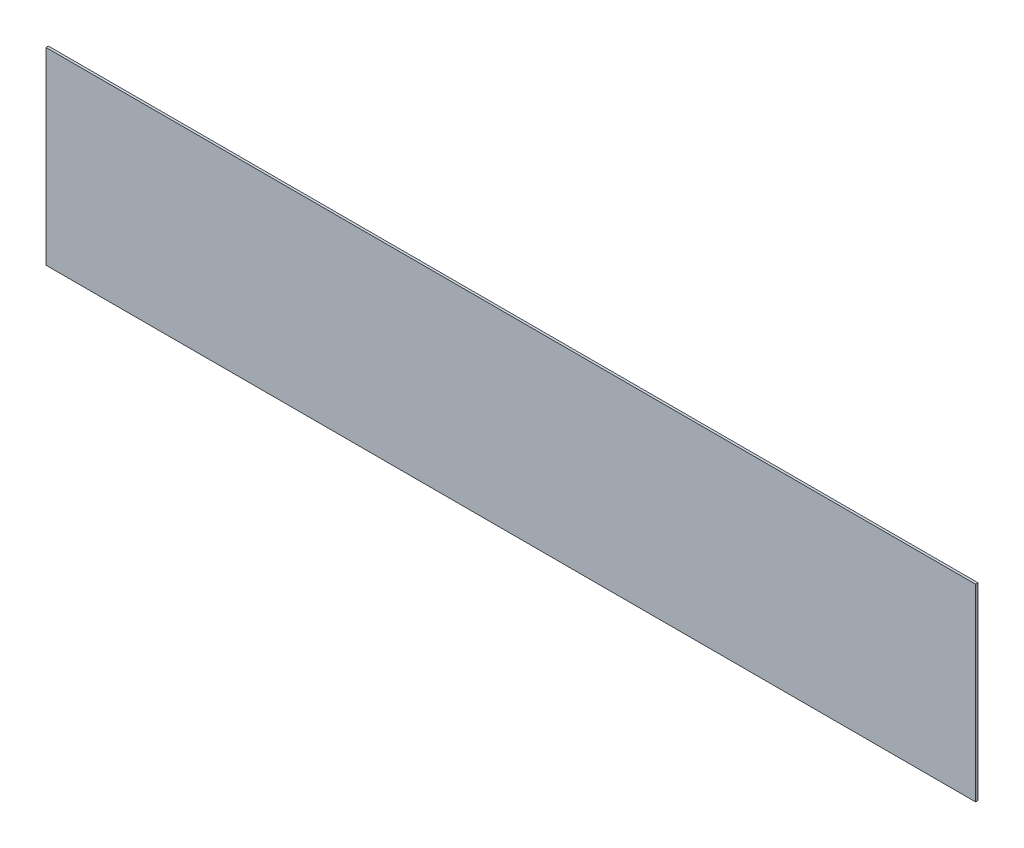
ISO-10303-21;
HEADER;
FILE_DESCRIPTION(('STEP AP214'),'2;1');
FILE_NAME('part.step','',(''),(''),'','','');
FILE_SCHEMA(('AUTOMOTIVE_DESIGN { 1 0 10303 214 1 1 1 1 }'));
ENDSEC;
DATA;
#1=APPLICATION_CONTEXT('core data for automotive mechanical design processes');
#2=APPLICATION_PROTOCOL_DEFINITION('international standard','automotive_design',2000,#1);
#3=PRODUCT_CONTEXT('',#1,'mechanical');
#4=PRODUCT('Part','Part','',(#3));
#5=PRODUCT_RELATED_PRODUCT_CATEGORY('part','',(#4));
#6=PRODUCT_DEFINITION_FORMATION('','',#4);
#7=PRODUCT_DEFINITION_CONTEXT('part definition',#1,'design');
#8=PRODUCT_DEFINITION('design','',#6,#7);
#9=PRODUCT_DEFINITION_SHAPE('','',#8);
#10=(LENGTH_UNIT() NAMED_UNIT(*) SI_UNIT(.MILLI.,.METRE.));
#11=(NAMED_UNIT(*) PLANE_ANGLE_UNIT() SI_UNIT($,.RADIAN.));
#12=(NAMED_UNIT(*) SI_UNIT($,.STERADIAN.) SOLID_ANGLE_UNIT());
#13=UNCERTAINTY_MEASURE_WITH_UNIT(LENGTH_MEASURE(1.E-05),#10,'distance_accuracy_value','');
#14=(GEOMETRIC_REPRESENTATION_CONTEXT(3) GLOBAL_UNCERTAINTY_ASSIGNED_CONTEXT((#13)) GLOBAL_UNIT_ASSIGNED_CONTEXT((#10,
#11,#12)) REPRESENTATION_CONTEXT('',''));
#15=CARTESIAN_POINT('',(0.,0.,0.));
#16=DIRECTION('',(0.,0.,1.));
#17=DIRECTION('',(1.,0.,0.));
#18=AXIS2_PLACEMENT_3D('',#15,#16,#17);
#19=CARTESIAN_POINT('',(0.,0.,1.5875));
#20=DIRECTION('',(1.,0.,0.));
#21=DIRECTION('',(0.,0.,-1.));
#22=AXIS2_PLACEMENT_3D('',#19,#20,#21);
#23=PLANE('',#22);
#24=DIRECTION('',(0.,-1.,0.));
#25=VECTOR('',#24,1.);
#26=CARTESIAN_POINT('',(0.,0.,0.));
#27=LINE('',#26,#25);
#28=CARTESIAN_POINT('',(0.,123.6726,0.));
#29=VERTEX_POINT('',#28);
#30=CARTESIAN_POINT('',(0.,0.,0.));
#31=VERTEX_POINT('',#30);
#32=EDGE_CURVE('E105',#29,#31,#27,.T.);
#33=ORIENTED_EDGE('',*,*,#32,.T.);
#34=DIRECTION('',(0.,0.,-1.));
#35=VECTOR('',#34,1.);
#36=CARTESIAN_POINT('',(0.,0.,1.5875));
#37=LINE('',#36,#35);
#38=CARTESIAN_POINT('',(0.,0.,1.5875));
#39=VERTEX_POINT('',#38);
#40=EDGE_CURVE('E11',#39,#31,#37,.T.);
#41=ORIENTED_EDGE('',*,*,#40,.F.);
#42=DIRECTION('',(0.,-1.,0.));
#43=VECTOR('',#42,1.);
#44=CARTESIAN_POINT('',(0.,0.,1.5875));
#45=LINE('',#44,#43);
#46=CARTESIAN_POINT('',(0.,123.6726,1.5875));
#47=VERTEX_POINT('',#46);
#48=EDGE_CURVE('E93',#47,#39,#45,.T.);
#49=ORIENTED_EDGE('',*,*,#48,.F.);
#50=DIRECTION('',(0.,0.,-1.));
#51=VECTOR('',#50,1.);
#52=CARTESIAN_POINT('',(0.,123.6726,1.5875));
#53=LINE('',#52,#51);
#54=EDGE_CURVE('E101',#47,#29,#53,.T.);
#55=ORIENTED_EDGE('',*,*,#54,.T.);
#56=EDGE_LOOP('',(#33,#41,#49,#55));
#57=FACE_BOUND('',#56,.T.);
#58=ADVANCED_FACE('F42',(#57),#23,.F.);
#59=CARTESIAN_POINT('',(0.,0.,1.5875));
#60=DIRECTION('',(0.,1.,0.));
#61=DIRECTION('',(0.,0.,1.));
#62=AXIS2_PLACEMENT_3D('',#59,#60,#61);
#63=PLANE('',#62);
#64=DIRECTION('',(1.,0.,0.));
#65=VECTOR('',#64,1.);
#66=CARTESIAN_POINT('',(0.,0.,0.));
#67=LINE('',#66,#65);
#68=CARTESIAN_POINT('',(609.6,0.,0.));
#69=VERTEX_POINT('',#68);
#70=EDGE_CURVE('E97',#31,#69,#67,.T.);
#71=ORIENTED_EDGE('',*,*,#70,.T.);
#72=DIRECTION('',(0.,0.,-1.));
#73=VECTOR('',#72,1.);
#74=CARTESIAN_POINT('',(609.6,0.,1.5875));
#75=LINE('',#74,#73);
#76=CARTESIAN_POINT('',(609.6,0.,1.5875));
#77=VERTEX_POINT('',#76);
#78=EDGE_CURVE('E50',#77,#69,#75,.T.);
#79=ORIENTED_EDGE('',*,*,#78,.F.);
#80=DIRECTION('',(1.,0.,0.));
#81=VECTOR('',#80,1.);
#82=CARTESIAN_POINT('',(0.,0.,1.5875));
#83=LINE('',#82,#81);
#84=EDGE_CURVE('E88',#39,#77,#83,.T.);
#85=ORIENTED_EDGE('',*,*,#84,.F.);
#86=ORIENTED_EDGE('',*,*,#40,.T.);
#87=EDGE_LOOP('',(#71,#79,#85,#86));
#88=FACE_BOUND('',#87,.T.);
#89=ADVANCED_FACE('F96',(#88),#63,.F.);
#90=CARTESIAN_POINT('',(609.6,0.,1.5875));
#91=DIRECTION('',(-1.,0.,0.));
#92=DIRECTION('',(0.,0.,1.));
#93=AXIS2_PLACEMENT_3D('',#90,#91,#92);
#94=PLANE('',#93);
#95=DIRECTION('',(0.,1.,0.));
#96=VECTOR('',#95,1.);
#97=CARTESIAN_POINT('',(609.6,0.,0.));
#98=LINE('',#97,#96);
#99=CARTESIAN_POINT('',(609.6,123.6726,0.));
#100=VERTEX_POINT('',#99);
#101=EDGE_CURVE('E75',#69,#100,#98,.T.);
#102=ORIENTED_EDGE('',*,*,#101,.T.);
#103=DIRECTION('',(0.,0.,-1.));
#104=VECTOR('',#103,1.);
#105=CARTESIAN_POINT('',(609.6,123.6726,1.5875));
#106=LINE('',#105,#104);
#107=CARTESIAN_POINT('',(609.6,123.6726,1.5875));
#108=VERTEX_POINT('',#107);
#109=EDGE_CURVE('E98',#108,#100,#106,.T.);
#110=ORIENTED_EDGE('',*,*,#109,.F.);
#111=DIRECTION('',(0.,1.,0.));
#112=VECTOR('',#111,1.);
#113=CARTESIAN_POINT('',(609.6,0.,1.5875));
#114=LINE('',#113,#112);
#115=EDGE_CURVE('E91',#77,#108,#114,.T.);
#116=ORIENTED_EDGE('',*,*,#115,.F.);
#117=ORIENTED_EDGE('',*,*,#78,.T.);
#118=EDGE_LOOP('',(#102,#110,#116,#117));
#119=FACE_BOUND('',#118,.T.);
#120=ADVANCED_FACE('F99',(#119),#94,.F.);
#121=CARTESIAN_POINT('',(0.,123.6726,1.5875));
#122=DIRECTION('',(0.,-1.,0.));
#123=DIRECTION('',(0.,0.,-1.));
#124=AXIS2_PLACEMENT_3D('',#121,#122,#123);
#125=PLANE('',#124);
#126=DIRECTION('',(-1.,0.,0.));
#127=VECTOR('',#126,1.);
#128=CARTESIAN_POINT('',(0.,123.6726,0.));
#129=LINE('',#128,#127);
#130=EDGE_CURVE('E81',#100,#29,#129,.T.);
#131=ORIENTED_EDGE('',*,*,#130,.T.);
#132=ORIENTED_EDGE('',*,*,#54,.F.);
#133=DIRECTION('',(-1.,0.,0.));
#134=VECTOR('',#133,1.);
#135=CARTESIAN_POINT('',(0.,123.6726,1.5875));
#136=LINE('',#135,#134);
#137=EDGE_CURVE('E58',#108,#47,#136,.T.);
#138=ORIENTED_EDGE('',*,*,#137,.F.);
#139=ORIENTED_EDGE('',*,*,#109,.T.);
#140=EDGE_LOOP('',(#131,#132,#138,#139));
#141=FACE_BOUND('',#140,.T.);
#142=ADVANCED_FACE('F112',(#141),#125,.F.);
#143=CARTESIAN_POINT('',(0.,0.,1.5875));
#144=DIRECTION('',(0.,0.,-1.));
#145=DIRECTION('',(-1.,0.,0.));
#146=AXIS2_PLACEMENT_3D('',#143,#144,#145);
#147=PLANE('',#146);
#148=ORIENTED_EDGE('',*,*,#48,.T.);
#149=ORIENTED_EDGE('',*,*,#84,.T.);
#150=ORIENTED_EDGE('',*,*,#115,.T.);
#151=ORIENTED_EDGE('',*,*,#137,.T.);
#152=EDGE_LOOP('',(#148,#149,#150,#151));
#153=FACE_BOUND('',#152,.T.);
#154=ADVANCED_FACE('F89',(#153),#147,.F.);
#155=CARTESIAN_POINT('',(0.,0.,0.));
#156=DIRECTION('',(0.,0.,-1.));
#157=DIRECTION('',(-1.,0.,0.));
#158=AXIS2_PLACEMENT_3D('',#155,#156,#157);
#159=PLANE('',#158);
#160=ORIENTED_EDGE('',*,*,#32,.F.);
#161=ORIENTED_EDGE('',*,*,#130,.F.);
#162=ORIENTED_EDGE('',*,*,#101,.F.);
#163=ORIENTED_EDGE('',*,*,#70,.F.);
#164=EDGE_LOOP('',(#160,#161,#162,#163));
#165=FACE_BOUND('',#164,.T.);
#166=ADVANCED_FACE('F115',(#165),#159,.T.);
#167=CLOSED_SHELL('',(#58,#89,#120,#142,#154,#166));
#168=MANIFOLD_SOLID_BREP('B2',#167);
#169=ADVANCED_BREP_SHAPE_REPRESENTATION('',(#18,#168),#14);
#170=SHAPE_DEFINITION_REPRESENTATION(#9,#169);
ENDSEC;
END-ISO-10303-21;
